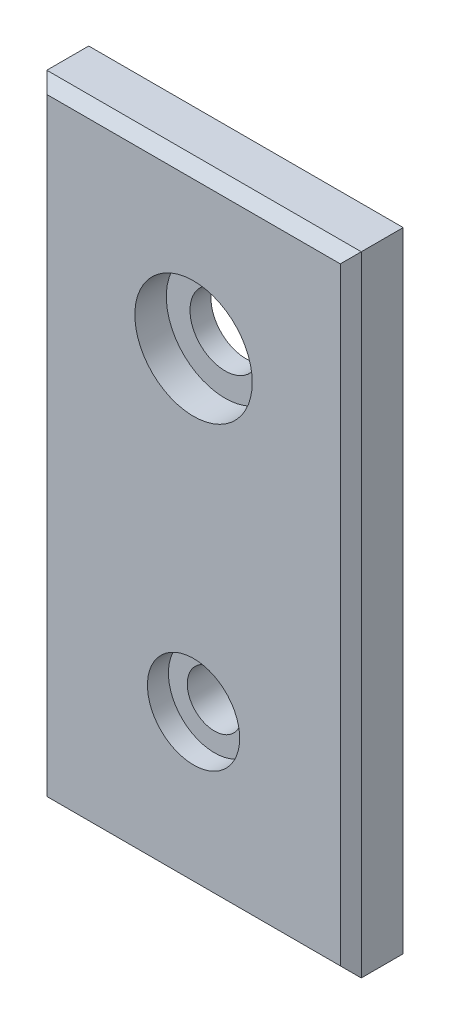
ISO-10303-21;
HEADER;
FILE_DESCRIPTION(('STEP AP214'),'2;1');
FILE_NAME('part.step','',(''),(''),'','','');
FILE_SCHEMA(('AUTOMOTIVE_DESIGN { 1 0 10303 214 1 1 1 1 }'));
ENDSEC;
DATA;
#1=APPLICATION_CONTEXT('core data for automotive mechanical design processes');
#2=APPLICATION_PROTOCOL_DEFINITION('international standard','automotive_design',2000,#1);
#3=PRODUCT_CONTEXT('',#1,'mechanical');
#4=PRODUCT('Part','Part','',(#3));
#5=PRODUCT_RELATED_PRODUCT_CATEGORY('part','',(#4));
#6=PRODUCT_DEFINITION_FORMATION('','',#4);
#7=PRODUCT_DEFINITION_CONTEXT('part definition',#1,'design');
#8=PRODUCT_DEFINITION('design','',#6,#7);
#9=PRODUCT_DEFINITION_SHAPE('','',#8);
#10=(LENGTH_UNIT() NAMED_UNIT(*) SI_UNIT(.MILLI.,.METRE.));
#11=(NAMED_UNIT(*) PLANE_ANGLE_UNIT() SI_UNIT($,.RADIAN.));
#12=(NAMED_UNIT(*) SI_UNIT($,.STERADIAN.) SOLID_ANGLE_UNIT());
#13=UNCERTAINTY_MEASURE_WITH_UNIT(LENGTH_MEASURE(1.E-05),#10,'distance_accuracy_value','');
#14=(GEOMETRIC_REPRESENTATION_CONTEXT(3) GLOBAL_UNCERTAINTY_ASSIGNED_CONTEXT((#13)) GLOBAL_UNIT_ASSIGNED_CONTEXT((#10,
#11,#12)) REPRESENTATION_CONTEXT('',''));
#15=CARTESIAN_POINT('',(0.,0.,0.));
#16=DIRECTION('',(0.,0.,1.));
#17=DIRECTION('',(1.,0.,0.));
#18=AXIS2_PLACEMENT_3D('',#15,#16,#17);
#19=CARTESIAN_POINT('',(31.7745345411141,138.045570059544,-11.9976221777484));
#20=DIRECTION('',(0.,0.,1.));
#21=DIRECTION('',(1.,0.,0.));
#22=AXIS2_PLACEMENT_3D('',#19,#20,#21);
#23=CYLINDRICAL_SURFACE('',#22,4.24180000000001);
#24=CARTESIAN_POINT('',(31.7745345411141,138.045570059544,0.));
#25=DIRECTION('',(0.,0.,1.));
#26=DIRECTION('',(1.,0.,0.));
#27=AXIS2_PLACEMENT_3D('',#24,#25,#26);
#28=CIRCLE('',#27,4.24180000000001);
#29=CARTESIAN_POINT('',(36.0163345411141,138.045570059544,0.));
#30=VERTEX_POINT('',#29);
#31=EDGE_CURVE('E109',#30,#30,#28,.F.);
#32=ORIENTED_EDGE('',*,*,#31,.T.);
#33=EDGE_LOOP('',(#32));
#34=FACE_BOUND('',#33,.T.);
#35=CARTESIAN_POINT('',(31.7745345411141,138.045570059544,2.54));
#36=DIRECTION('',(0.,0.,1.));
#37=DIRECTION('',(1.,0.,0.));
#38=AXIS2_PLACEMENT_3D('',#35,#36,#37);
#39=CIRCLE('',#38,4.24180000000001);
#40=CARTESIAN_POINT('',(36.0163345411141,138.045570059544,2.54));
#41=VERTEX_POINT('',#40);
#42=EDGE_CURVE('E41',#41,#41,#39,.F.);
#43=ORIENTED_EDGE('',*,*,#42,.F.);
#44=EDGE_LOOP('',(#43));
#45=FACE_BOUND('',#44,.T.);
#46=ADVANCED_FACE('F36',(#34,#45),#23,.F.);
#47=CARTESIAN_POINT('',(31.774534541114,99.9455700595437,-11.9976221777484));
#48=DIRECTION('',(0.,0.,1.));
#49=DIRECTION('',(1.,0.,0.));
#50=AXIS2_PLACEMENT_3D('',#47,#48,#49);
#51=CYLINDRICAL_SURFACE('',#50,3.302);
#52=CARTESIAN_POINT('',(31.774534541114,99.9455700595437,0.));
#53=DIRECTION('',(0.,0.,1.));
#54=DIRECTION('',(1.,0.,0.));
#55=AXIS2_PLACEMENT_3D('',#52,#53,#54);
#56=CIRCLE('',#55,3.302);
#57=CARTESIAN_POINT('',(35.076534541114,99.9455700595437,0.));
#58=VERTEX_POINT('',#57);
#59=EDGE_CURVE('E112',#58,#58,#56,.F.);
#60=ORIENTED_EDGE('',*,*,#59,.T.);
#61=EDGE_LOOP('',(#60));
#62=FACE_BOUND('',#61,.T.);
#63=CARTESIAN_POINT('',(31.774534541114,99.9455700595437,3.81));
#64=DIRECTION('',(0.,0.,1.));
#65=DIRECTION('',(1.,0.,0.));
#66=AXIS2_PLACEMENT_3D('',#63,#64,#65);
#67=CIRCLE('',#66,3.302);
#68=CARTESIAN_POINT('',(35.076534541114,99.9455700595437,3.81));
#69=VERTEX_POINT('',#68);
#70=EDGE_CURVE('E139',#69,#69,#67,.F.);
#71=ORIENTED_EDGE('',*,*,#70,.F.);
#72=EDGE_LOOP('',(#71));
#73=FACE_BOUND('',#72,.T.);
#74=ADVANCED_FACE('F171',(#62,#73),#51,.F.);
#75=CARTESIAN_POINT('',(12.7245345411139,157.095570059543,6.35));
#76=DIRECTION('',(1.,0.,0.));
#77=DIRECTION('',(0.,1.,0.));
#78=AXIS2_PLACEMENT_3D('',#75,#76,#77);
#79=PLANE('',#78);
#80=DIRECTION('',(0.,0.,-1.));
#81=VECTOR('',#80,1.);
#82=CARTESIAN_POINT('',(12.7245345411139,80.8955700595437,6.35));
#83=LINE('',#82,#81);
#84=CARTESIAN_POINT('',(12.7245345411139,80.8955700595437,5.08000000000001));
#85=VERTEX_POINT('',#84);
#86=CARTESIAN_POINT('',(12.7245345411139,80.8955700595437,0.));
#87=VERTEX_POINT('',#86);
#88=EDGE_CURVE('E89',#85,#87,#83,.T.);
#89=ORIENTED_EDGE('',*,*,#88,.F.);
#90=DIRECTION('',(0.,1.,0.));
#91=VECTOR('',#90,1.);
#92=CARTESIAN_POINT('',(12.7245345411139,157.095570059543,5.08000000000001));
#93=LINE('',#92,#91);
#94=CARTESIAN_POINT('',(12.7245345411139,157.095570059543,5.08000000000001));
#95=VERTEX_POINT('',#94);
#96=EDGE_CURVE('E46',#85,#95,#93,.T.);
#97=ORIENTED_EDGE('',*,*,#96,.T.);
#98=DIRECTION('',(0.,0.,-1.));
#99=VECTOR('',#98,1.);
#100=CARTESIAN_POINT('',(12.7245345411139,157.095570059543,6.35));
#101=LINE('',#100,#99);
#102=CARTESIAN_POINT('',(12.7245345411139,157.095570059543,0.));
#103=VERTEX_POINT('',#102);
#104=EDGE_CURVE('E107',#95,#103,#101,.T.);
#105=ORIENTED_EDGE('',*,*,#104,.T.);
#106=DIRECTION('',(0.,-1.,0.));
#107=VECTOR('',#106,1.);
#108=CARTESIAN_POINT('',(12.7245345411139,157.095570059543,0.));
#109=LINE('',#108,#107);
#110=EDGE_CURVE('E102',#103,#87,#109,.T.);
#111=ORIENTED_EDGE('',*,*,#110,.T.);
#112=EDGE_LOOP('',(#89,#97,#105,#111));
#113=FACE_BOUND('',#112,.T.);
#114=ADVANCED_FACE('F106',(#113),#79,.F.);
#115=CARTESIAN_POINT('',(12.7245345411139,80.8955700595437,6.35));
#116=DIRECTION('',(0.,1.,0.));
#117=DIRECTION('',(0.,0.,1.));
#118=AXIS2_PLACEMENT_3D('',#115,#116,#117);
#119=PLANE('',#118);
#120=DIRECTION('',(0.,0.,-1.));
#121=VECTOR('',#120,1.);
#122=CARTESIAN_POINT('',(50.8245345411141,80.8955700595437,6.35));
#123=LINE('',#122,#121);
#124=CARTESIAN_POINT('',(50.8245345411141,80.8955700595437,5.08000000000001));
#125=VERTEX_POINT('',#124);
#126=CARTESIAN_POINT('',(50.8245345411141,80.8955700595437,0.));
#127=VERTEX_POINT('',#126);
#128=EDGE_CURVE('E96',#125,#127,#123,.T.);
#129=ORIENTED_EDGE('',*,*,#128,.F.);
#130=DIRECTION('',(-1.,0.,0.));
#131=VECTOR('',#130,1.);
#132=CARTESIAN_POINT('',(12.7245345411139,80.8955700595437,5.08000000000001));
#133=LINE('',#132,#131);
#134=EDGE_CURVE('E61',#125,#85,#133,.T.);
#135=ORIENTED_EDGE('',*,*,#134,.T.);
#136=ORIENTED_EDGE('',*,*,#88,.T.);
#137=DIRECTION('',(1.,0.,0.));
#138=VECTOR('',#137,1.);
#139=CARTESIAN_POINT('',(12.7245345411139,80.8955700595437,0.));
#140=LINE('',#139,#138);
#141=EDGE_CURVE('E92',#87,#127,#140,.T.);
#142=ORIENTED_EDGE('',*,*,#141,.T.);
#143=EDGE_LOOP('',(#129,#135,#136,#142));
#144=FACE_BOUND('',#143,.T.);
#145=ADVANCED_FACE('F91',(#144),#119,.F.);
#146=CARTESIAN_POINT('',(50.8245345411141,80.8955700595437,6.35));
#147=DIRECTION('',(-1.,0.,0.));
#148=DIRECTION('',(0.,0.,1.));
#149=AXIS2_PLACEMENT_3D('',#146,#147,#148);
#150=PLANE('',#149);
#151=DIRECTION('',(0.,0.,-1.));
#152=VECTOR('',#151,1.);
#153=CARTESIAN_POINT('',(50.8245345411141,157.095570059544,6.35));
#154=LINE('',#153,#152);
#155=CARTESIAN_POINT('',(50.8245345411141,157.095570059544,5.08000000000001));
#156=VERTEX_POINT('',#155);
#157=CARTESIAN_POINT('',(50.8245345411141,157.095570059544,0.));
#158=VERTEX_POINT('',#157);
#159=EDGE_CURVE('E120',#156,#158,#154,.T.);
#160=ORIENTED_EDGE('',*,*,#159,.F.);
#161=DIRECTION('',(0.,-1.,0.));
#162=VECTOR('',#161,1.);
#163=CARTESIAN_POINT('',(50.8245345411141,80.8955700595437,5.08000000000001));
#164=LINE('',#163,#162);
#165=EDGE_CURVE('E131',#156,#125,#164,.T.);
#166=ORIENTED_EDGE('',*,*,#165,.T.);
#167=ORIENTED_EDGE('',*,*,#128,.T.);
#168=DIRECTION('',(0.,1.,0.));
#169=VECTOR('',#168,1.);
#170=CARTESIAN_POINT('',(50.8245345411141,80.8955700595437,0.));
#171=LINE('',#170,#169);
#172=EDGE_CURVE('E104',#127,#158,#171,.T.);
#173=ORIENTED_EDGE('',*,*,#172,.T.);
#174=EDGE_LOOP('',(#160,#166,#167,#173));
#175=FACE_BOUND('',#174,.T.);
#176=ADVANCED_FACE('F193',(#175),#150,.F.);
#177=CARTESIAN_POINT('',(50.8245345411141,157.095570059544,6.35));
#178=DIRECTION('',(0.,-1.,0.));
#179=DIRECTION('',(1.,0.,0.));
#180=AXIS2_PLACEMENT_3D('',#177,#178,#179);
#181=PLANE('',#180);
#182=ORIENTED_EDGE('',*,*,#104,.F.);
#183=DIRECTION('',(1.,0.,0.));
#184=VECTOR('',#183,1.);
#185=CARTESIAN_POINT('',(50.8245345411141,157.095570059544,5.08000000000001));
#186=LINE('',#185,#184);
#187=EDGE_CURVE('E11',#95,#156,#186,.T.);
#188=ORIENTED_EDGE('',*,*,#187,.T.);
#189=ORIENTED_EDGE('',*,*,#159,.T.);
#190=DIRECTION('',(-1.,0.,0.));
#191=VECTOR('',#190,1.);
#192=CARTESIAN_POINT('',(50.8245345411141,157.095570059544,0.));
#193=LINE('',#192,#191);
#194=EDGE_CURVE('E117',#158,#103,#193,.T.);
#195=ORIENTED_EDGE('',*,*,#194,.T.);
#196=EDGE_LOOP('',(#182,#188,#189,#195));
#197=FACE_BOUND('',#196,.T.);
#198=ADVANCED_FACE('F186',(#197),#181,.F.);
#199=CARTESIAN_POINT('',(0.,0.,6.35));
#200=DIRECTION('',(0.,0.,1.));
#201=DIRECTION('',(1.,0.,0.));
#202=AXIS2_PLACEMENT_3D('',#199,#200,#201);
#203=PLANE('',#202);
#204=CARTESIAN_POINT('',(31.7745345411141,138.045570059544,6.35));
#205=DIRECTION('',(0.,0.,1.));
#206=DIRECTION('',(1.,0.,0.));
#207=AXIS2_PLACEMENT_3D('',#204,#205,#206);
#208=CIRCLE('',#207,7.112);
#209=CARTESIAN_POINT('',(38.8865345411141,138.045570059544,6.35));
#210=VERTEX_POINT('',#209);
#211=EDGE_CURVE('E158',#210,#210,#208,.T.);
#212=ORIENTED_EDGE('',*,*,#211,.F.);
#213=EDGE_LOOP('',(#212));
#214=FACE_BOUND('',#213,.T.);
#215=CARTESIAN_POINT('',(31.774534541114,99.9455700595437,6.35));
#216=DIRECTION('',(0.,0.,1.));
#217=DIRECTION('',(1.,0.,0.));
#218=AXIS2_PLACEMENT_3D('',#215,#216,#217);
#219=CIRCLE('',#218,5.588);
#220=CARTESIAN_POINT('',(37.362534541114,99.9455700595437,6.35));
#221=VERTEX_POINT('',#220);
#222=EDGE_CURVE('E151',#221,#221,#219,.T.);
#223=ORIENTED_EDGE('',*,*,#222,.F.);
#224=EDGE_LOOP('',(#223));
#225=FACE_BOUND('',#224,.T.);
#226=DIRECTION('',(1.,0.,0.));
#227=VECTOR('',#226,1.);
#228=CARTESIAN_POINT('',(50.8245345411141,82.1655700595437,6.35));
#229=LINE('',#228,#227);
#230=CARTESIAN_POINT('',(13.9945345411139,82.1655700595437,6.35));
#231=VERTEX_POINT('',#230);
#232=CARTESIAN_POINT('',(49.5545345411141,82.1655700595437,6.35));
#233=VERTEX_POINT('',#232);
#234=EDGE_CURVE('E126',#231,#233,#229,.T.);
#235=ORIENTED_EDGE('',*,*,#234,.T.);
#236=DIRECTION('',(0.,1.,0.));
#237=VECTOR('',#236,1.);
#238=CARTESIAN_POINT('',(49.5545345411141,157.095570059544,6.35));
#239=LINE('',#238,#237);
#240=CARTESIAN_POINT('',(49.5545345411141,155.825570059544,6.35));
#241=VERTEX_POINT('',#240);
#242=EDGE_CURVE('E128',#233,#241,#239,.T.);
#243=ORIENTED_EDGE('',*,*,#242,.T.);
#244=DIRECTION('',(-1.,0.,0.));
#245=VECTOR('',#244,1.);
#246=CARTESIAN_POINT('',(12.7245345411139,155.825570059543,6.35));
#247=LINE('',#246,#245);
#248=CARTESIAN_POINT('',(13.9945345411139,155.825570059543,6.35));
#249=VERTEX_POINT('',#248);
#250=EDGE_CURVE('E95',#241,#249,#247,.T.);
#251=ORIENTED_EDGE('',*,*,#250,.T.);
#252=DIRECTION('',(0.,-1.,0.));
#253=VECTOR('',#252,1.);
#254=CARTESIAN_POINT('',(13.9945345411139,80.8955700595437,6.35));
#255=LINE('',#254,#253);
#256=EDGE_CURVE('E124',#249,#231,#255,.T.);
#257=ORIENTED_EDGE('',*,*,#256,.T.);
#258=EDGE_LOOP('',(#235,#243,#251,#257));
#259=FACE_BOUND('',#258,.T.);
#260=ADVANCED_FACE('F183',(#214,#225,#259),#203,.T.);
#261=CARTESIAN_POINT('',(0.,0.,0.));
#262=DIRECTION('',(0.,0.,1.));
#263=DIRECTION('',(1.,0.,0.));
#264=AXIS2_PLACEMENT_3D('',#261,#262,#263);
#265=PLANE('',#264);
#266=ORIENTED_EDGE('',*,*,#31,.F.);
#267=EDGE_LOOP('',(#266));
#268=FACE_BOUND('',#267,.T.);
#269=ORIENTED_EDGE('',*,*,#59,.F.);
#270=EDGE_LOOP('',(#269));
#271=FACE_BOUND('',#270,.T.);
#272=ORIENTED_EDGE('',*,*,#110,.F.);
#273=ORIENTED_EDGE('',*,*,#194,.F.);
#274=ORIENTED_EDGE('',*,*,#172,.F.);
#275=ORIENTED_EDGE('',*,*,#141,.F.);
#276=EDGE_LOOP('',(#272,#273,#274,#275));
#277=FACE_BOUND('',#276,.T.);
#278=ADVANCED_FACE('F100',(#268,#271,#277),#265,.F.);
#279=CARTESIAN_POINT('',(13.994534541114,0.,6.35));
#280=DIRECTION('',(-0.707106781186548,0.,0.707106781186547));
#281=DIRECTION('',(0.,1.,0.));
#282=AXIS2_PLACEMENT_3D('',#279,#280,#281);
#283=PLANE('',#282);
#284=DIRECTION('',(0.577350269189627,-0.577350269189623,0.577350269189627));
#285=VECTOR('',#284,1.);
#286=CARTESIAN_POINT('',(9.32968969407561,160.490414906582,1.6851551529617));
#287=LINE('',#286,#285);
#288=EDGE_CURVE('E141',#95,#249,#287,.T.);
#289=ORIENTED_EDGE('',*,*,#288,.F.);
#290=ORIENTED_EDGE('',*,*,#96,.F.);
#291=DIRECTION('',(0.577350269189626,0.577350269189626,0.577350269189626));
#292=VECTOR('',#291,1.);
#293=CARTESIAN_POINT('',(-13.3939888120673,54.7770467063625,-21.0385233531812));
#294=LINE('',#293,#292);
#295=EDGE_CURVE('E144',#231,#85,#294,.F.);
#296=ORIENTED_EDGE('',*,*,#295,.F.);
#297=ORIENTED_EDGE('',*,*,#256,.F.);
#298=EDGE_LOOP('',(#289,#290,#296,#297));
#299=FACE_BOUND('',#298,.T.);
#300=ADVANCED_FACE('F39',(#299),#283,.T.);
#301=CARTESIAN_POINT('',(0.,82.1655700595437,6.35));
#302=DIRECTION('',(0.,-0.707106781186548,0.707106781186548));
#303=DIRECTION('',(-1.,0.,0.));
#304=AXIS2_PLACEMENT_3D('',#301,#302,#303);
#305=PLANE('',#304);
#306=ORIENTED_EDGE('',*,*,#295,.T.);
#307=ORIENTED_EDGE('',*,*,#134,.F.);
#308=DIRECTION('',(-0.577350269189626,0.577350269189626,0.577350269189626));
#309=VECTOR('',#308,1.);
#310=CARTESIAN_POINT('',(33.0363563607427,98.6837482399151,22.8681781803714));
#311=LINE('',#310,#309);
#312=EDGE_CURVE('E138',#233,#125,#311,.F.);
#313=ORIENTED_EDGE('',*,*,#312,.F.);
#314=ORIENTED_EDGE('',*,*,#234,.F.);
#315=EDGE_LOOP('',(#306,#307,#313,#314));
#316=FACE_BOUND('',#315,.T.);
#317=ADVANCED_FACE('F216',(#316),#305,.T.);
#318=CARTESIAN_POINT('',(-1.021660250229E-12,155.825570059543,6.35));
#319=DIRECTION('',(0.,0.707106781186548,0.707106781186547));
#320=DIRECTION('',(1.,0.,0.));
#321=AXIS2_PLACEMENT_3D('',#318,#319,#320);
#322=PLANE('',#321);
#323=ORIENTED_EDGE('',*,*,#288,.T.);
#324=ORIENTED_EDGE('',*,*,#250,.F.);
#325=DIRECTION('',(0.577350269189625,0.577350269189628,-0.577350269189625));
#326=VECTOR('',#325,1.);
#327=CARTESIAN_POINT('',(33.0363563607423,139.307391879172,22.8681781803717));
#328=LINE('',#327,#326);
#329=EDGE_CURVE('E136',#156,#241,#328,.F.);
#330=ORIENTED_EDGE('',*,*,#329,.F.);
#331=ORIENTED_EDGE('',*,*,#187,.F.);
#332=EDGE_LOOP('',(#323,#324,#330,#331));
#333=FACE_BOUND('',#332,.T.);
#334=ADVANCED_FACE('F210',(#333),#322,.T.);
#335=CARTESIAN_POINT('',(49.5545345411141,0.,6.35));
#336=DIRECTION('',(0.707106781186548,0.,0.707106781186548));
#337=DIRECTION('',(0.,-1.,0.));
#338=AXIS2_PLACEMENT_3D('',#335,#336,#337);
#339=PLANE('',#338);
#340=ORIENTED_EDGE('',*,*,#312,.T.);
#341=ORIENTED_EDGE('',*,*,#165,.F.);
#342=ORIENTED_EDGE('',*,*,#329,.T.);
#343=ORIENTED_EDGE('',*,*,#242,.F.);
#344=EDGE_LOOP('',(#340,#341,#342,#343));
#345=FACE_BOUND('',#344,.T.);
#346=ADVANCED_FACE('F203',(#345),#339,.T.);
#347=CARTESIAN_POINT('',(31.774534541114,99.9455700595437,3.81));
#348=DIRECTION('',(0.,0.,1.));
#349=DIRECTION('',(1.,0.,0.));
#350=AXIS2_PLACEMENT_3D('',#347,#348,#349);
#351=PLANE('',#350);
#352=CARTESIAN_POINT('',(31.774534541114,99.9455700595437,3.81));
#353=DIRECTION('',(0.,0.,1.));
#354=DIRECTION('',(1.,0.,0.));
#355=AXIS2_PLACEMENT_3D('',#352,#353,#354);
#356=CIRCLE('',#355,5.588);
#357=CARTESIAN_POINT('',(37.362534541114,99.9455700595437,3.81));
#358=VERTEX_POINT('',#357);
#359=EDGE_CURVE('E147',#358,#358,#356,.T.);
#360=ORIENTED_EDGE('',*,*,#359,.T.);
#361=EDGE_LOOP('',(#360));
#362=FACE_BOUND('',#361,.T.);
#363=ORIENTED_EDGE('',*,*,#70,.T.);
#364=EDGE_LOOP('',(#363));
#365=FACE_BOUND('',#364,.T.);
#366=ADVANCED_FACE('F209',(#362,#365),#351,.T.);
#367=CARTESIAN_POINT('',(31.774534541114,99.9455700595437,3.81));
#368=DIRECTION('',(0.,0.,1.));
#369=DIRECTION('',(1.,0.,0.));
#370=AXIS2_PLACEMENT_3D('',#367,#368,#369);
#371=CYLINDRICAL_SURFACE('',#370,5.588);
#372=ORIENTED_EDGE('',*,*,#359,.F.);
#373=EDGE_LOOP('',(#372));
#374=FACE_BOUND('',#373,.T.);
#375=ORIENTED_EDGE('',*,*,#222,.T.);
#376=EDGE_LOOP('',(#375));
#377=FACE_BOUND('',#376,.T.);
#378=ADVANCED_FACE('F180',(#374,#377),#371,.F.);
#379=CARTESIAN_POINT('',(31.7745345411141,138.045570059544,2.54));
#380=DIRECTION('',(0.,0.,1.));
#381=DIRECTION('',(1.,0.,0.));
#382=AXIS2_PLACEMENT_3D('',#379,#380,#381);
#383=PLANE('',#382);
#384=CARTESIAN_POINT('',(31.7745345411141,138.045570059544,2.54));
#385=DIRECTION('',(0.,0.,1.));
#386=DIRECTION('',(1.,0.,0.));
#387=AXIS2_PLACEMENT_3D('',#384,#385,#386);
#388=CIRCLE('',#387,7.112);
#389=CARTESIAN_POINT('',(38.8865345411141,138.045570059544,2.54));
#390=VERTEX_POINT('',#389);
#391=EDGE_CURVE('E161',#390,#390,#388,.T.);
#392=ORIENTED_EDGE('',*,*,#391,.T.);
#393=EDGE_LOOP('',(#392));
#394=FACE_BOUND('',#393,.T.);
#395=ORIENTED_EDGE('',*,*,#42,.T.);
#396=EDGE_LOOP('',(#395));
#397=FACE_BOUND('',#396,.T.);
#398=ADVANCED_FACE('F168',(#394,#397),#383,.T.);
#399=CARTESIAN_POINT('',(31.7745345411141,138.045570059544,2.54));
#400=DIRECTION('',(0.,0.,1.));
#401=DIRECTION('',(1.,0.,0.));
#402=AXIS2_PLACEMENT_3D('',#399,#400,#401);
#403=CYLINDRICAL_SURFACE('',#402,7.112);
#404=ORIENTED_EDGE('',*,*,#391,.F.);
#405=EDGE_LOOP('',(#404));
#406=FACE_BOUND('',#405,.T.);
#407=ORIENTED_EDGE('',*,*,#211,.T.);
#408=EDGE_LOOP('',(#407));
#409=FACE_BOUND('',#408,.T.);
#410=ADVANCED_FACE('F301',(#406,#409),#403,.F.);
#411=CLOSED_SHELL('',(#46,#74,#114,#145,#176,#198,#260,#278,#300,#317,#334,#346,#366,#378,#398,#410));
#412=MANIFOLD_SOLID_BREP('B2',#411);
#413=ADVANCED_BREP_SHAPE_REPRESENTATION('',(#18,#412),#14);
#414=SHAPE_DEFINITION_REPRESENTATION(#9,#413);
ENDSEC;
END-ISO-10303-21;
